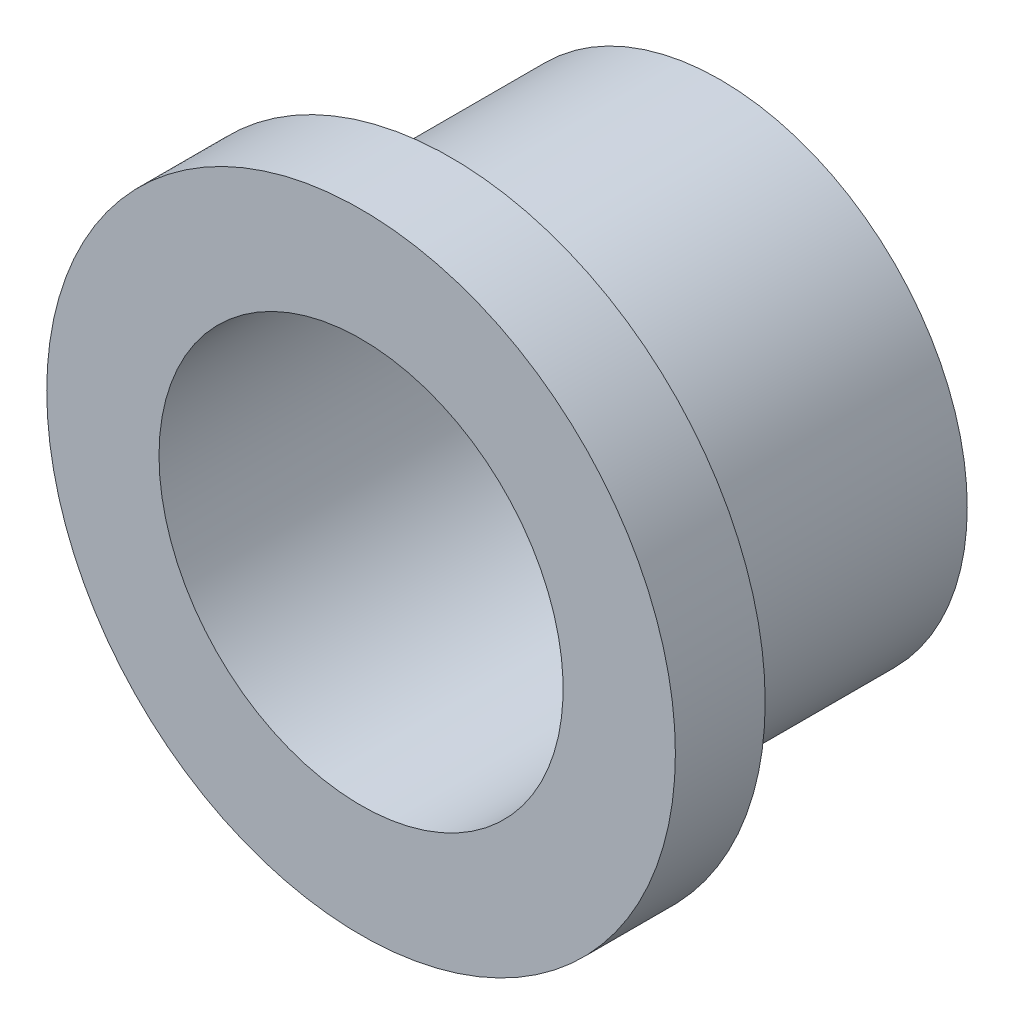
ISO-10303-21;
HEADER;
FILE_DESCRIPTION(('STEP AP214'),'2;1');
FILE_NAME('part.step','',(''),(''),'','','');
FILE_SCHEMA(('AUTOMOTIVE_DESIGN { 1 0 10303 214 1 1 1 1 }'));
ENDSEC;
DATA;
#1=APPLICATION_CONTEXT('core data for automotive mechanical design processes');
#2=APPLICATION_PROTOCOL_DEFINITION('international standard','automotive_design',2000,#1);
#3=PRODUCT_CONTEXT('',#1,'mechanical');
#4=PRODUCT('Part','Part','',(#3));
#5=PRODUCT_RELATED_PRODUCT_CATEGORY('part','',(#4));
#6=PRODUCT_DEFINITION_FORMATION('','',#4);
#7=PRODUCT_DEFINITION_CONTEXT('part definition',#1,'design');
#8=PRODUCT_DEFINITION('design','',#6,#7);
#9=PRODUCT_DEFINITION_SHAPE('','',#8);
#10=(LENGTH_UNIT() NAMED_UNIT(*) SI_UNIT(.MILLI.,.METRE.));
#11=(NAMED_UNIT(*) PLANE_ANGLE_UNIT() SI_UNIT($,.RADIAN.));
#12=(NAMED_UNIT(*) SI_UNIT($,.STERADIAN.) SOLID_ANGLE_UNIT());
#13=UNCERTAINTY_MEASURE_WITH_UNIT(LENGTH_MEASURE(1.E-05),#10,'distance_accuracy_value','');
#14=(GEOMETRIC_REPRESENTATION_CONTEXT(3) GLOBAL_UNCERTAINTY_ASSIGNED_CONTEXT((#13)) GLOBAL_UNIT_ASSIGNED_CONTEXT((#10,
#11,#12)) REPRESENTATION_CONTEXT('',''));
#15=CARTESIAN_POINT('',(0.,0.,0.));
#16=DIRECTION('',(0.,0.,1.));
#17=DIRECTION('',(1.,0.,0.));
#18=AXIS2_PLACEMENT_3D('',#15,#16,#17);
#19=CARTESIAN_POINT('',(0.,0.,-15.));
#20=DIRECTION('',(0.,0.,1.));
#21=DIRECTION('',(1.,0.,0.));
#22=AXIS2_PLACEMENT_3D('',#19,#20,#21);
#23=PLANE('',#22);
#24=CARTESIAN_POINT('',(0.,0.,-15.));
#25=DIRECTION('',(0.,0.,1.));
#26=DIRECTION('',(1.,0.,0.));
#27=AXIS2_PLACEMENT_3D('',#24,#25,#26);
#28=CIRCLE('',#27,27.5);
#29=CARTESIAN_POINT('',(27.5,0.,-15.));
#30=VERTEX_POINT('',#29);
#31=EDGE_CURVE('E41',#30,#30,#28,.T.);
#32=ORIENTED_EDGE('',*,*,#31,.F.);
#33=EDGE_LOOP('',(#32));
#34=FACE_BOUND('',#33,.T.);
#35=CARTESIAN_POINT('',(0.,0.,-15.));
#36=DIRECTION('',(0.,0.,1.));
#37=DIRECTION('',(1.,0.,0.));
#38=AXIS2_PLACEMENT_3D('',#35,#36,#37);
#39=CIRCLE('',#38,22.5);
#40=CARTESIAN_POINT('',(22.5,0.,-15.));
#41=VERTEX_POINT('',#40);
#42=EDGE_CURVE('E50',#41,#41,#39,.T.);
#43=ORIENTED_EDGE('',*,*,#42,.T.);
#44=EDGE_LOOP('',(#43));
#45=FACE_BOUND('',#44,.T.);
#46=ADVANCED_FACE('F37',(#34,#45),#23,.F.);
#47=CARTESIAN_POINT('',(0.,0.,15.));
#48=DIRECTION('',(0.,0.,-1.));
#49=DIRECTION('',(-1.,0.,0.));
#50=AXIS2_PLACEMENT_3D('',#47,#48,#49);
#51=CYLINDRICAL_SURFACE('',#50,27.5);
#52=CARTESIAN_POINT('',(0.,0.,15.));
#53=DIRECTION('',(0.,0.,1.));
#54=DIRECTION('',(1.,0.,0.));
#55=AXIS2_PLACEMENT_3D('',#52,#53,#54);
#56=CIRCLE('',#55,27.5);
#57=CARTESIAN_POINT('',(27.5,0.,15.));
#58=VERTEX_POINT('',#57);
#59=EDGE_CURVE('E10',#58,#58,#56,.T.);
#60=ORIENTED_EDGE('',*,*,#59,.F.);
#61=EDGE_LOOP('',(#60));
#62=FACE_BOUND('',#61,.T.);
#63=ORIENTED_EDGE('',*,*,#31,.T.);
#64=EDGE_LOOP('',(#63));
#65=FACE_BOUND('',#64,.T.);
#66=ADVANCED_FACE('F39',(#62,#65),#51,.T.);
#67=CARTESIAN_POINT('',(0.,0.,15.));
#68=DIRECTION('',(0.,0.,-1.));
#69=DIRECTION('',(-1.,0.,0.));
#70=AXIS2_PLACEMENT_3D('',#67,#68,#69);
#71=CYLINDRICAL_SURFACE('',#70,22.5);
#72=ORIENTED_EDGE('',*,*,#42,.F.);
#73=EDGE_LOOP('',(#72));
#74=FACE_BOUND('',#73,.T.);
#75=CARTESIAN_POINT('',(0.,0.,25.));
#76=DIRECTION('',(0.,0.,-1.));
#77=DIRECTION('',(-1.,0.,0.));
#78=AXIS2_PLACEMENT_3D('',#75,#76,#77);
#79=CIRCLE('',#78,22.5);
#80=CARTESIAN_POINT('',(-22.5,0.,25.));
#81=VERTEX_POINT('',#80);
#82=EDGE_CURVE('E60',#81,#81,#79,.T.);
#83=ORIENTED_EDGE('',*,*,#82,.F.);
#84=EDGE_LOOP('',(#83));
#85=FACE_BOUND('',#84,.T.);
#86=ADVANCED_FACE('F71',(#74,#85),#71,.F.);
#87=CARTESIAN_POINT('',(0.,0.,25.));
#88=DIRECTION('',(0.,0.,-1.));
#89=DIRECTION('',(-1.,0.,0.));
#90=AXIS2_PLACEMENT_3D('',#87,#88,#89);
#91=CYLINDRICAL_SURFACE('',#90,35.);
#92=CARTESIAN_POINT('',(0.,0.,25.));
#93=DIRECTION('',(0.,0.,1.));
#94=DIRECTION('',(1.,0.,0.));
#95=AXIS2_PLACEMENT_3D('',#92,#93,#94);
#96=CIRCLE('',#95,35.);
#97=CARTESIAN_POINT('',(35.,0.,25.));
#98=VERTEX_POINT('',#97);
#99=EDGE_CURVE('E55',#98,#98,#96,.T.);
#100=ORIENTED_EDGE('',*,*,#99,.F.);
#101=EDGE_LOOP('',(#100));
#102=FACE_BOUND('',#101,.T.);
#103=CARTESIAN_POINT('',(0.,0.,15.));
#104=DIRECTION('',(0.,0.,1.));
#105=DIRECTION('',(1.,0.,0.));
#106=AXIS2_PLACEMENT_3D('',#103,#104,#105);
#107=CIRCLE('',#106,35.);
#108=CARTESIAN_POINT('',(35.,0.,15.));
#109=VERTEX_POINT('',#108);
#110=EDGE_CURVE('E56',#109,#109,#107,.T.);
#111=ORIENTED_EDGE('',*,*,#110,.T.);
#112=EDGE_LOOP('',(#111));
#113=FACE_BOUND('',#112,.T.);
#114=ADVANCED_FACE('F73',(#102,#113),#91,.T.);
#115=CARTESIAN_POINT('',(0.,0.,25.));
#116=DIRECTION('',(0.,0.,1.));
#117=DIRECTION('',(1.,0.,0.));
#118=AXIS2_PLACEMENT_3D('',#115,#116,#117);
#119=PLANE('',#118);
#120=ORIENTED_EDGE('',*,*,#82,.T.);
#121=EDGE_LOOP('',(#120));
#122=FACE_BOUND('',#121,.T.);
#123=ORIENTED_EDGE('',*,*,#99,.T.);
#124=EDGE_LOOP('',(#123));
#125=FACE_BOUND('',#124,.T.);
#126=ADVANCED_FACE('F68',(#122,#125),#119,.T.);
#127=CARTESIAN_POINT('',(0.,0.,15.));
#128=DIRECTION('',(0.,0.,1.));
#129=DIRECTION('',(1.,0.,0.));
#130=AXIS2_PLACEMENT_3D('',#127,#128,#129);
#131=PLANE('',#130);
#132=ORIENTED_EDGE('',*,*,#59,.T.);
#133=EDGE_LOOP('',(#132));
#134=FACE_BOUND('',#133,.T.);
#135=ORIENTED_EDGE('',*,*,#110,.F.);
#136=EDGE_LOOP('',(#135));
#137=FACE_BOUND('',#136,.T.);
#138=ADVANCED_FACE('F109',(#134,#137),#131,.F.);
#139=CLOSED_SHELL('',(#46,#66,#86,#114,#126,#138));
#140=MANIFOLD_SOLID_BREP('B2',#139);
#141=ADVANCED_BREP_SHAPE_REPRESENTATION('',(#18,#140),#14);
#142=SHAPE_DEFINITION_REPRESENTATION(#9,#141);
ENDSEC;
END-ISO-10303-21;
